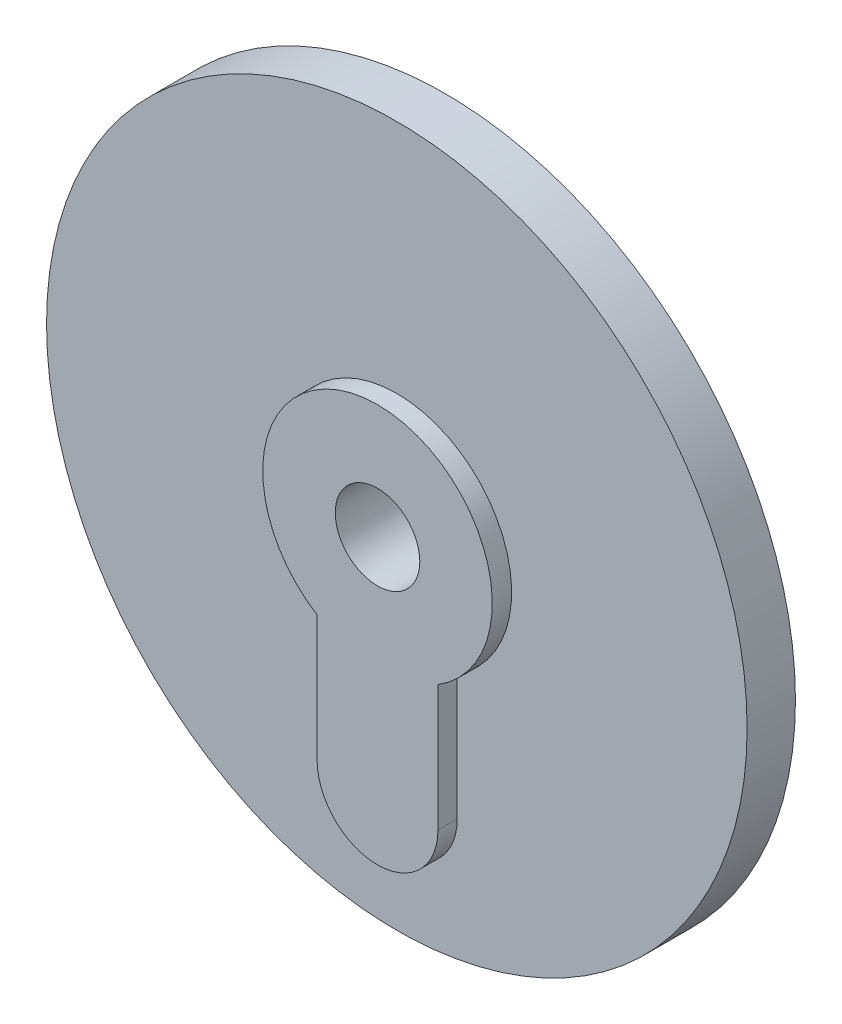
ISO-10303-21;
HEADER;
FILE_DESCRIPTION(('STEP AP214'),'2;1');
FILE_NAME('part.step','',(''),(''),'','','');
FILE_SCHEMA(('AUTOMOTIVE_DESIGN { 1 0 10303 214 1 1 1 1 }'));
ENDSEC;
DATA;
#1=APPLICATION_CONTEXT('core data for automotive mechanical design processes');
#2=APPLICATION_PROTOCOL_DEFINITION('international standard','automotive_design',2000,#1);
#3=PRODUCT_CONTEXT('',#1,'mechanical');
#4=PRODUCT('Part','Part','',(#3));
#5=PRODUCT_RELATED_PRODUCT_CATEGORY('part','',(#4));
#6=PRODUCT_DEFINITION_FORMATION('','',#4);
#7=PRODUCT_DEFINITION_CONTEXT('part definition',#1,'design');
#8=PRODUCT_DEFINITION('design','',#6,#7);
#9=PRODUCT_DEFINITION_SHAPE('','',#8);
#10=(LENGTH_UNIT() NAMED_UNIT(*) SI_UNIT(.MILLI.,.METRE.));
#11=(NAMED_UNIT(*) PLANE_ANGLE_UNIT() SI_UNIT($,.RADIAN.));
#12=(NAMED_UNIT(*) SI_UNIT($,.STERADIAN.) SOLID_ANGLE_UNIT());
#13=UNCERTAINTY_MEASURE_WITH_UNIT(LENGTH_MEASURE(1.E-05),#10,'distance_accuracy_value','');
#14=(GEOMETRIC_REPRESENTATION_CONTEXT(3) GLOBAL_UNCERTAINTY_ASSIGNED_CONTEXT((#13)) GLOBAL_UNIT_ASSIGNED_CONTEXT((#10,
#11,#12)) REPRESENTATION_CONTEXT('',''));
#15=CARTESIAN_POINT('',(0.,0.,0.));
#16=DIRECTION('',(0.,0.,1.));
#17=DIRECTION('',(1.,0.,0.));
#18=AXIS2_PLACEMENT_3D('',#15,#16,#17);
#19=CARTESIAN_POINT('',(0.,0.,2.));
#20=DIRECTION('',(0.,0.,1.));
#21=DIRECTION('',(1.,0.,0.));
#22=AXIS2_PLACEMENT_3D('',#19,#20,#21);
#23=PLANE('',#22);
#24=CARTESIAN_POINT('',(0.,0.,2.));
#25=DIRECTION('',(0.,0.,1.));
#26=DIRECTION('',(1.,0.,0.));
#27=AXIS2_PLACEMENT_3D('',#24,#25,#26);
#28=CIRCLE('',#27,14.5);
#29=CARTESIAN_POINT('',(14.5,0.,2.));
#30=VERTEX_POINT('',#29);
#31=EDGE_CURVE('E11',#30,#30,#28,.T.);
#32=ORIENTED_EDGE('',*,*,#31,.T.);
#33=EDGE_LOOP('',(#32));
#34=FACE_BOUND('',#33,.T.);
#35=DIRECTION('',(0.,1.,0.));
#36=VECTOR('',#35,1.);
#37=CARTESIAN_POINT('',(-2.5,0.,2.));
#38=LINE('',#37,#36);
#39=CARTESIAN_POINT('',(-2.5,-9.25,2.));
#40=VERTEX_POINT('',#39);
#41=CARTESIAN_POINT('',(-2.5,-4.03887360535088,2.));
#42=VERTEX_POINT('',#41);
#43=EDGE_CURVE('E104',#40,#42,#38,.T.);
#44=ORIENTED_EDGE('',*,*,#43,.T.);
#45=CARTESIAN_POINT('',(0.,0.,2.));
#46=DIRECTION('',(0.,0.,1.));
#47=DIRECTION('',(1.,0.,0.));
#48=AXIS2_PLACEMENT_3D('',#45,#46,#47);
#49=CIRCLE('',#48,4.75);
#50=CARTESIAN_POINT('',(2.5,-4.03887360535088,2.));
#51=VERTEX_POINT('',#50);
#52=EDGE_CURVE('E107',#51,#42,#49,.T.);
#53=ORIENTED_EDGE('',*,*,#52,.F.);
#54=DIRECTION('',(0.,1.,0.));
#55=VECTOR('',#54,1.);
#56=CARTESIAN_POINT('',(2.5,0.,2.));
#57=LINE('',#56,#55);
#58=CARTESIAN_POINT('',(2.5,-9.25,2.));
#59=VERTEX_POINT('',#58);
#60=EDGE_CURVE('E91',#59,#51,#57,.T.);
#61=ORIENTED_EDGE('',*,*,#60,.F.);
#62=CARTESIAN_POINT('',(0.,-9.25,2.));
#63=DIRECTION('',(0.,0.,1.));
#64=DIRECTION('',(1.,0.,0.));
#65=AXIS2_PLACEMENT_3D('',#62,#63,#64);
#66=CIRCLE('',#65,2.5);
#67=EDGE_CURVE('E99',#40,#59,#66,.T.);
#68=ORIENTED_EDGE('',*,*,#67,.F.);
#69=EDGE_LOOP('',(#44,#53,#61,#68));
#70=FACE_BOUND('',#69,.T.);
#71=ADVANCED_FACE('F35',(#34,#70),#23,.T.);
#72=CARTESIAN_POINT('',(0.,0.,2.));
#73=DIRECTION('',(0.,0.,-1.));
#74=DIRECTION('',(-1.,0.,0.));
#75=AXIS2_PLACEMENT_3D('',#72,#73,#74);
#76=CYLINDRICAL_SURFACE('',#75,14.5);
#77=ORIENTED_EDGE('',*,*,#31,.F.);
#78=EDGE_LOOP('',(#77));
#79=FACE_BOUND('',#78,.T.);
#80=CARTESIAN_POINT('',(0.,0.,0.));
#81=DIRECTION('',(0.,0.,1.));
#82=DIRECTION('',(1.,0.,0.));
#83=AXIS2_PLACEMENT_3D('',#80,#81,#82);
#84=CIRCLE('',#83,14.5);
#85=CARTESIAN_POINT('',(14.5,0.,0.));
#86=VERTEX_POINT('',#85);
#87=EDGE_CURVE('E39',#86,#86,#84,.T.);
#88=ORIENTED_EDGE('',*,*,#87,.T.);
#89=EDGE_LOOP('',(#88));
#90=FACE_BOUND('',#89,.T.);
#91=ADVANCED_FACE('F37',(#79,#90),#76,.T.);
#92=CARTESIAN_POINT('',(0.,0.,0.));
#93=DIRECTION('',(0.,0.,1.));
#94=DIRECTION('',(1.,0.,0.));
#95=AXIS2_PLACEMENT_3D('',#92,#93,#94);
#96=PLANE('',#95);
#97=CARTESIAN_POINT('',(0.,0.,0.));
#98=DIRECTION('',(0.,0.,1.));
#99=DIRECTION('',(1.,0.,0.));
#100=AXIS2_PLACEMENT_3D('',#97,#98,#99);
#101=CIRCLE('',#100,1.75);
#102=CARTESIAN_POINT('',(1.75,0.,0.));
#103=VERTEX_POINT('',#102);
#104=EDGE_CURVE('E143',#103,#103,#101,.T.);
#105=ORIENTED_EDGE('',*,*,#104,.T.);
#106=EDGE_LOOP('',(#105));
#107=FACE_BOUND('',#106,.T.);
#108=ORIENTED_EDGE('',*,*,#87,.F.);
#109=EDGE_LOOP('',(#108));
#110=FACE_BOUND('',#109,.T.);
#111=ADVANCED_FACE('F125',(#107,#110),#96,.F.);
#112=CARTESIAN_POINT('',(-2.5,0.,2.8));
#113=DIRECTION('',(-1.,0.,0.));
#114=DIRECTION('',(0.,0.,1.));
#115=AXIS2_PLACEMENT_3D('',#112,#113,#114);
#116=PLANE('',#115);
#117=ORIENTED_EDGE('',*,*,#43,.F.);
#118=DIRECTION('',(0.,0.,-1.));
#119=VECTOR('',#118,1.);
#120=CARTESIAN_POINT('',(-2.5,-9.25,2.8));
#121=LINE('',#120,#119);
#122=CARTESIAN_POINT('',(-2.5,-9.25,2.8));
#123=VERTEX_POINT('',#122);
#124=EDGE_CURVE('E59',#123,#40,#121,.T.);
#125=ORIENTED_EDGE('',*,*,#124,.F.);
#126=DIRECTION('',(0.,1.,0.));
#127=VECTOR('',#126,1.);
#128=CARTESIAN_POINT('',(-2.5,0.,2.8));
#129=LINE('',#128,#127);
#130=CARTESIAN_POINT('',(-2.5,-4.03887360535088,2.8));
#131=VERTEX_POINT('',#130);
#132=EDGE_CURVE('E97',#123,#131,#129,.T.);
#133=ORIENTED_EDGE('',*,*,#132,.T.);
#134=DIRECTION('',(0.,0.,-1.));
#135=VECTOR('',#134,1.);
#136=CARTESIAN_POINT('',(-2.5,-4.03887360535088,2.8));
#137=LINE('',#136,#135);
#138=EDGE_CURVE('E94',#131,#42,#137,.T.);
#139=ORIENTED_EDGE('',*,*,#138,.T.);
#140=EDGE_LOOP('',(#117,#125,#133,#139));
#141=FACE_BOUND('',#140,.T.);
#142=ADVANCED_FACE('F114',(#141),#116,.T.);
#143=CARTESIAN_POINT('',(0.,-9.25,2.8));
#144=DIRECTION('',(0.,0.,-1.));
#145=DIRECTION('',(-1.,0.,0.));
#146=AXIS2_PLACEMENT_3D('',#143,#144,#145);
#147=CYLINDRICAL_SURFACE('',#146,2.5);
#148=ORIENTED_EDGE('',*,*,#67,.T.);
#149=DIRECTION('',(0.,0.,-1.));
#150=VECTOR('',#149,1.);
#151=CARTESIAN_POINT('',(2.5,-9.25,2.8));
#152=LINE('',#151,#150);
#153=CARTESIAN_POINT('',(2.5,-9.25,2.8));
#154=VERTEX_POINT('',#153);
#155=EDGE_CURVE('E93',#154,#59,#152,.T.);
#156=ORIENTED_EDGE('',*,*,#155,.F.);
#157=CARTESIAN_POINT('',(0.,-9.25,2.8));
#158=DIRECTION('',(0.,0.,1.));
#159=DIRECTION('',(1.,0.,0.));
#160=AXIS2_PLACEMENT_3D('',#157,#158,#159);
#161=CIRCLE('',#160,2.5);
#162=EDGE_CURVE('E84',#123,#154,#161,.T.);
#163=ORIENTED_EDGE('',*,*,#162,.F.);
#164=ORIENTED_EDGE('',*,*,#124,.T.);
#165=EDGE_LOOP('',(#148,#156,#163,#164));
#166=FACE_BOUND('',#165,.T.);
#167=ADVANCED_FACE('F117',(#166),#147,.T.);
#168=CARTESIAN_POINT('',(2.5,0.,2.8));
#169=DIRECTION('',(-1.,0.,0.));
#170=DIRECTION('',(0.,-1.,0.));
#171=AXIS2_PLACEMENT_3D('',#168,#169,#170);
#172=PLANE('',#171);
#173=ORIENTED_EDGE('',*,*,#60,.T.);
#174=DIRECTION('',(0.,0.,-1.));
#175=VECTOR('',#174,1.);
#176=CARTESIAN_POINT('',(2.5,-4.03887360535088,2.8));
#177=LINE('',#176,#175);
#178=CARTESIAN_POINT('',(2.5,-4.03887360535088,2.8));
#179=VERTEX_POINT('',#178);
#180=EDGE_CURVE('E50',#179,#51,#177,.T.);
#181=ORIENTED_EDGE('',*,*,#180,.F.);
#182=DIRECTION('',(0.,1.,0.));
#183=VECTOR('',#182,1.);
#184=CARTESIAN_POINT('',(2.5,0.,2.8));
#185=LINE('',#184,#183);
#186=EDGE_CURVE('E82',#154,#179,#185,.T.);
#187=ORIENTED_EDGE('',*,*,#186,.F.);
#188=ORIENTED_EDGE('',*,*,#155,.T.);
#189=EDGE_LOOP('',(#173,#181,#187,#188));
#190=FACE_BOUND('',#189,.T.);
#191=ADVANCED_FACE('F89',(#190),#172,.F.);
#192=CARTESIAN_POINT('',(0.,0.,2.8));
#193=DIRECTION('',(0.,0.,-1.));
#194=DIRECTION('',(-1.,0.,0.));
#195=AXIS2_PLACEMENT_3D('',#192,#193,#194);
#196=CYLINDRICAL_SURFACE('',#195,4.75);
#197=ORIENTED_EDGE('',*,*,#52,.T.);
#198=ORIENTED_EDGE('',*,*,#138,.F.);
#199=CARTESIAN_POINT('',(0.,0.,2.8));
#200=DIRECTION('',(0.,0.,1.));
#201=DIRECTION('',(1.,0.,0.));
#202=AXIS2_PLACEMENT_3D('',#199,#200,#201);
#203=CIRCLE('',#202,4.75);
#204=EDGE_CURVE('E79',#179,#131,#203,.T.);
#205=ORIENTED_EDGE('',*,*,#204,.F.);
#206=ORIENTED_EDGE('',*,*,#180,.T.);
#207=EDGE_LOOP('',(#197,#198,#205,#206));
#208=FACE_BOUND('',#207,.T.);
#209=ADVANCED_FACE('F96',(#208),#196,.T.);
#210=CARTESIAN_POINT('',(0.,0.,2.8));
#211=DIRECTION('',(0.,0.,1.));
#212=DIRECTION('',(1.,0.,0.));
#213=AXIS2_PLACEMENT_3D('',#210,#211,#212);
#214=PLANE('',#213);
#215=CARTESIAN_POINT('',(0.,0.,2.8));
#216=DIRECTION('',(0.,0.,1.));
#217=DIRECTION('',(1.,0.,0.));
#218=AXIS2_PLACEMENT_3D('',#215,#216,#217);
#219=CIRCLE('',#218,1.75);
#220=CARTESIAN_POINT('',(1.75,0.,2.8));
#221=VERTEX_POINT('',#220);
#222=EDGE_CURVE('E108',#221,#221,#219,.T.);
#223=ORIENTED_EDGE('',*,*,#222,.F.);
#224=EDGE_LOOP('',(#223));
#225=FACE_BOUND('',#224,.T.);
#226=ORIENTED_EDGE('',*,*,#132,.F.);
#227=ORIENTED_EDGE('',*,*,#162,.T.);
#228=ORIENTED_EDGE('',*,*,#186,.T.);
#229=ORIENTED_EDGE('',*,*,#204,.T.);
#230=EDGE_LOOP('',(#226,#227,#228,#229));
#231=FACE_BOUND('',#230,.T.);
#232=ADVANCED_FACE('F83',(#225,#231),#214,.T.);
#233=CARTESIAN_POINT('',(0.,0.,2.8));
#234=DIRECTION('',(0.,0.,-1.));
#235=DIRECTION('',(-1.,0.,0.));
#236=AXIS2_PLACEMENT_3D('',#233,#234,#235);
#237=CYLINDRICAL_SURFACE('',#236,1.75);
#238=ORIENTED_EDGE('',*,*,#222,.T.);
#239=EDGE_LOOP('',(#238));
#240=FACE_BOUND('',#239,.T.);
#241=ORIENTED_EDGE('',*,*,#104,.F.);
#242=EDGE_LOOP('',(#241));
#243=FACE_BOUND('',#242,.T.);
#244=ADVANCED_FACE('F152',(#240,#243),#237,.F.);
#245=CLOSED_SHELL('',(#71,#91,#111,#142,#167,#191,#209,#232,#244));
#246=MANIFOLD_SOLID_BREP('B2',#245);
#247=ADVANCED_BREP_SHAPE_REPRESENTATION('',(#18,#246),#14);
#248=SHAPE_DEFINITION_REPRESENTATION(#9,#247);
ENDSEC;
END-ISO-10303-21;
